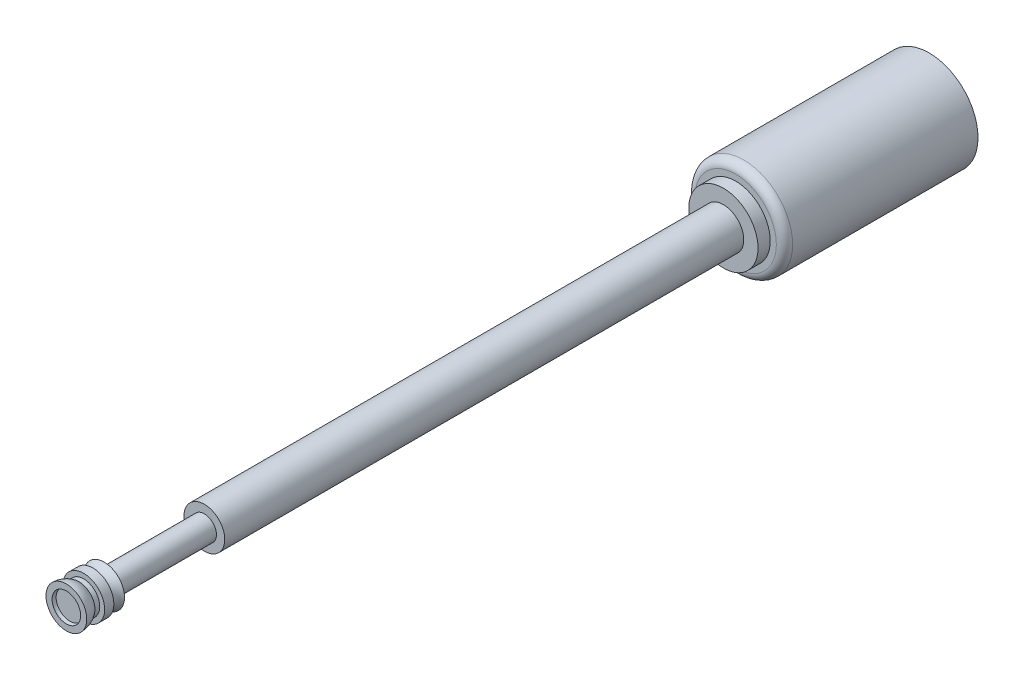
ISO-10303-21;
HEADER;
FILE_DESCRIPTION(('STEP AP214'),'2;1');
FILE_NAME('part.step','',(''),(''),'','','');
FILE_SCHEMA(('AUTOMOTIVE_DESIGN { 1 0 10303 214 1 1 1 1 }'));
ENDSEC;
DATA;
#1=APPLICATION_CONTEXT('core data for automotive mechanical design processes');
#2=APPLICATION_PROTOCOL_DEFINITION('international standard','automotive_design',2000,#1);
#3=PRODUCT_CONTEXT('',#1,'mechanical');
#4=PRODUCT('Part','Part','',(#3));
#5=PRODUCT_RELATED_PRODUCT_CATEGORY('part','',(#4));
#6=PRODUCT_DEFINITION_FORMATION('','',#4);
#7=PRODUCT_DEFINITION_CONTEXT('part definition',#1,'design');
#8=PRODUCT_DEFINITION('design','',#6,#7);
#9=PRODUCT_DEFINITION_SHAPE('','',#8);
#10=(LENGTH_UNIT() NAMED_UNIT(*) SI_UNIT(.MILLI.,.METRE.));
#11=(NAMED_UNIT(*) PLANE_ANGLE_UNIT() SI_UNIT($,.RADIAN.));
#12=(NAMED_UNIT(*) SI_UNIT($,.STERADIAN.) SOLID_ANGLE_UNIT());
#13=UNCERTAINTY_MEASURE_WITH_UNIT(LENGTH_MEASURE(1.E-05),#10,'distance_accuracy_value','');
#14=(GEOMETRIC_REPRESENTATION_CONTEXT(3) GLOBAL_UNCERTAINTY_ASSIGNED_CONTEXT((#13)) GLOBAL_UNIT_ASSIGNED_CONTEXT((#10,
#11,#12)) REPRESENTATION_CONTEXT('',''));
#15=CARTESIAN_POINT('',(0.,0.,0.));
#16=DIRECTION('',(0.,0.,1.));
#17=DIRECTION('',(1.,0.,0.));
#18=AXIS2_PLACEMENT_3D('',#15,#16,#17);
#19=CARTESIAN_POINT('',(0.,0.,15.5));
#20=DIRECTION('',(0.,0.,-1.));
#21=DIRECTION('',(-1.,0.,0.));
#22=AXIS2_PLACEMENT_3D('',#19,#20,#21);
#23=CYLINDRICAL_SURFACE('',#22,0.5);
#24=CARTESIAN_POINT('',(0.,0.,13.04));
#25=DIRECTION('',(0.,0.,-1.));
#26=DIRECTION('',(-1.,0.,0.));
#27=AXIS2_PLACEMENT_3D('',#24,#25,#26);
#28=CIRCLE('',#27,0.5);
#29=CARTESIAN_POINT('',(-0.5,0.,13.04));
#30=VERTEX_POINT('',#29);
#31=EDGE_CURVE('E60',#30,#30,#28,.T.);
#32=ORIENTED_EDGE('',*,*,#31,.T.);
#33=EDGE_LOOP('',(#32));
#34=FACE_BOUND('',#33,.T.);
#35=CARTESIAN_POINT('',(0.,0.,0.3));
#36=DIRECTION('',(0.,0.,1.));
#37=DIRECTION('',(1.,0.,0.));
#38=AXIS2_PLACEMENT_3D('',#35,#36,#37);
#39=CIRCLE('',#38,0.5);
#40=CARTESIAN_POINT('',(0.5,0.,0.3));
#41=VERTEX_POINT('',#40);
#42=EDGE_CURVE('E47',#41,#41,#39,.T.);
#43=ORIENTED_EDGE('',*,*,#42,.T.);
#44=EDGE_LOOP('',(#43));
#45=FACE_BOUND('',#44,.T.);
#46=ADVANCED_FACE('F36',(#34,#45),#23,.T.);
#47=CARTESIAN_POINT('',(0.,0.,0.3));
#48=DIRECTION('',(0.,0.,-1.));
#49=DIRECTION('',(-1.,0.,0.));
#50=AXIS2_PLACEMENT_3D('',#47,#48,#49);
#51=CYLINDRICAL_SURFACE('',#50,0.85);
#52=CARTESIAN_POINT('',(0.,0.,0.3));
#53=DIRECTION('',(0.,0.,1.));
#54=DIRECTION('',(1.,0.,0.));
#55=AXIS2_PLACEMENT_3D('',#52,#53,#54);
#56=CIRCLE('',#55,0.85);
#57=CARTESIAN_POINT('',(0.85,0.,0.3));
#58=VERTEX_POINT('',#57);
#59=EDGE_CURVE('E52',#58,#58,#56,.T.);
#60=ORIENTED_EDGE('',*,*,#59,.F.);
#61=EDGE_LOOP('',(#60));
#62=FACE_BOUND('',#61,.T.);
#63=CARTESIAN_POINT('',(0.,0.,0.));
#64=DIRECTION('',(0.,0.,1.));
#65=DIRECTION('',(1.,0.,0.));
#66=AXIS2_PLACEMENT_3D('',#63,#64,#65);
#67=CIRCLE('',#66,0.85);
#68=CARTESIAN_POINT('',(0.85,0.,0.));
#69=VERTEX_POINT('',#68);
#70=EDGE_CURVE('E106',#69,#69,#67,.T.);
#71=ORIENTED_EDGE('',*,*,#70,.T.);
#72=EDGE_LOOP('',(#71));
#73=FACE_BOUND('',#72,.T.);
#74=ADVANCED_FACE('F113',(#62,#73),#51,.T.);
#75=CARTESIAN_POINT('',(0.,0.,0.3));
#76=DIRECTION('',(0.,0.,1.));
#77=DIRECTION('',(1.,0.,0.));
#78=AXIS2_PLACEMENT_3D('',#75,#76,#77);
#79=PLANE('',#78);
#80=ORIENTED_EDGE('',*,*,#42,.F.);
#81=EDGE_LOOP('',(#80));
#82=FACE_BOUND('',#81,.T.);
#83=ORIENTED_EDGE('',*,*,#59,.T.);
#84=EDGE_LOOP('',(#83));
#85=FACE_BOUND('',#84,.T.);
#86=ADVANCED_FACE('F111',(#82,#85),#79,.T.);
#87=CARTESIAN_POINT('',(0.,0.,-4.75));
#88=DIRECTION('',(0.,0.,1.));
#89=DIRECTION('',(1.,0.,0.));
#90=AXIS2_PLACEMENT_3D('',#87,#88,#89);
#91=CYLINDRICAL_SURFACE('',#90,1.2);
#92=CARTESIAN_POINT('',(0.,0.,-0.2));
#93=DIRECTION('',(0.,0.,1.));
#94=DIRECTION('',(1.,0.,0.));
#95=AXIS2_PLACEMENT_3D('',#92,#93,#94);
#96=CIRCLE('',#95,1.2);
#97=CARTESIAN_POINT('',(1.2,0.,-0.2));
#98=VERTEX_POINT('',#97);
#99=EDGE_CURVE('E103',#98,#98,#96,.F.);
#100=ORIENTED_EDGE('',*,*,#99,.T.);
#101=EDGE_LOOP('',(#100));
#102=FACE_BOUND('',#101,.T.);
#103=CARTESIAN_POINT('',(0.,0.,-4.75));
#104=DIRECTION('',(0.,0.,1.));
#105=DIRECTION('',(1.,0.,0.));
#106=AXIS2_PLACEMENT_3D('',#103,#104,#105);
#107=CIRCLE('',#106,1.2);
#108=CARTESIAN_POINT('',(1.2,0.,-4.75));
#109=VERTEX_POINT('',#108);
#110=EDGE_CURVE('E97',#109,#109,#107,.T.);
#111=ORIENTED_EDGE('',*,*,#110,.T.);
#112=EDGE_LOOP('',(#111));
#113=FACE_BOUND('',#112,.T.);
#114=ADVANCED_FACE('F147',(#102,#113),#91,.T.);
#115=CARTESIAN_POINT('',(0.,0.,-4.75));
#116=DIRECTION('',(0.,0.,1.));
#117=DIRECTION('',(1.,0.,0.));
#118=AXIS2_PLACEMENT_3D('',#115,#116,#117);
#119=PLANE('',#118);
#120=ORIENTED_EDGE('',*,*,#110,.F.);
#121=EDGE_LOOP('',(#120));
#122=FACE_BOUND('',#121,.T.);
#123=ADVANCED_FACE('F123',(#122),#119,.F.);
#124=CARTESIAN_POINT('',(0.,0.,0.));
#125=DIRECTION('',(0.,0.,1.));
#126=DIRECTION('',(1.,0.,0.));
#127=AXIS2_PLACEMENT_3D('',#124,#125,#126);
#128=PLANE('',#127);
#129=ORIENTED_EDGE('',*,*,#70,.F.);
#130=EDGE_LOOP('',(#129));
#131=FACE_BOUND('',#130,.T.);
#132=CARTESIAN_POINT('',(0.,0.,0.));
#133=DIRECTION('',(0.,0.,1.));
#134=DIRECTION('',(1.,0.,0.));
#135=AXIS2_PLACEMENT_3D('',#132,#133,#134);
#136=CIRCLE('',#135,1.);
#137=CARTESIAN_POINT('',(1.,0.,0.));
#138=VERTEX_POINT('',#137);
#139=EDGE_CURVE('E100',#138,#138,#136,.T.);
#140=ORIENTED_EDGE('',*,*,#139,.T.);
#141=EDGE_LOOP('',(#140));
#142=FACE_BOUND('',#141,.T.);
#143=ADVANCED_FACE('F119',(#131,#142),#128,.T.);
#144=CARTESIAN_POINT('',(0.,0.,-0.2));
#145=DIRECTION('',(0.,0.,1.));
#146=DIRECTION('',(1.,0.,0.));
#147=AXIS2_PLACEMENT_3D('',#144,#145,#146);
#148=TOROIDAL_SURFACE('',#147,1.,0.2);
#149=ORIENTED_EDGE('',*,*,#99,.F.);
#150=EDGE_LOOP('',(#149));
#151=FACE_BOUND('',#150,.T.);
#152=ORIENTED_EDGE('',*,*,#139,.F.);
#153=EDGE_LOOP('',(#152));
#154=FACE_BOUND('',#153,.T.);
#155=ADVANCED_FACE('F122',(#151,#154),#148,.T.);
#156=CARTESIAN_POINT('',(-0.2962,0.,13.04));
#157=DIRECTION('',(0.,0.,-1.));
#158=DIRECTION('',(-1.,0.,0.));
#159=AXIS2_PLACEMENT_3D('',#156,#157,#158);
#160=PLANE('',#159);
#161=CARTESIAN_POINT('',(0.,0.,13.04));
#162=DIRECTION('',(0.,0.,-1.));
#163=DIRECTION('',(-1.,0.,0.));
#164=AXIS2_PLACEMENT_3D('',#161,#162,#163);
#165=CIRCLE('',#164,0.2962);
#166=CARTESIAN_POINT('',(-0.2962,0.,13.04));
#167=VERTEX_POINT('',#166);
#168=EDGE_CURVE('E68',#167,#167,#165,.T.);
#169=ORIENTED_EDGE('',*,*,#168,.T.);
#170=EDGE_LOOP('',(#169));
#171=FACE_BOUND('',#170,.T.);
#172=ORIENTED_EDGE('',*,*,#31,.F.);
#173=EDGE_LOOP('',(#172));
#174=FACE_BOUND('',#173,.T.);
#175=ADVANCED_FACE('F128',(#171,#174),#160,.F.);
#176=CARTESIAN_POINT('',(-0.2962,0.,15.5));
#177=DIRECTION('',(0.,0.,1.));
#178=DIRECTION('',(1.,0.,0.));
#179=AXIS2_PLACEMENT_3D('',#176,#177,#178);
#180=PLANE('',#179);
#181=CARTESIAN_POINT('',(0.,0.,15.5));
#182=DIRECTION('',(0.,0.,-1.));
#183=DIRECTION('',(-1.,0.,0.));
#184=AXIS2_PLACEMENT_3D('',#181,#182,#183);
#185=CIRCLE('',#184,0.2962);
#186=CARTESIAN_POINT('',(-0.2962,0.,15.5));
#187=VERTEX_POINT('',#186);
#188=EDGE_CURVE('E73',#187,#187,#185,.T.);
#189=ORIENTED_EDGE('',*,*,#188,.F.);
#190=EDGE_LOOP('',(#189));
#191=FACE_BOUND('',#190,.T.);
#192=CARTESIAN_POINT('',(0.,0.,15.5));
#193=DIRECTION('',(0.,0.,-1.));
#194=DIRECTION('',(-1.,0.,0.));
#195=AXIS2_PLACEMENT_3D('',#192,#193,#194);
#196=CIRCLE('',#195,0.5);
#197=CARTESIAN_POINT('',(-0.5,0.,15.5));
#198=VERTEX_POINT('',#197);
#199=EDGE_CURVE('E64',#198,#198,#196,.F.);
#200=ORIENTED_EDGE('',*,*,#199,.F.);
#201=EDGE_LOOP('',(#200));
#202=FACE_BOUND('',#201,.T.);
#203=ADVANCED_FACE('F134',(#191,#202),#180,.F.);
#204=CARTESIAN_POINT('',(0.,0.,15.5));
#205=DIRECTION('',(0.,0.,-1.));
#206=DIRECTION('',(-1.,0.,0.));
#207=AXIS2_PLACEMENT_3D('',#204,#205,#206);
#208=CYLINDRICAL_SURFACE('',#207,0.2962);
#209=ORIENTED_EDGE('',*,*,#168,.F.);
#210=EDGE_LOOP('',(#209));
#211=FACE_BOUND('',#210,.T.);
#212=ORIENTED_EDGE('',*,*,#188,.T.);
#213=EDGE_LOOP('',(#212));
#214=FACE_BOUND('',#213,.T.);
#215=ADVANCED_FACE('F191',(#211,#214),#208,.T.);
#216=CARTESIAN_POINT('',(0.,0.,16.34));
#217=DIRECTION('',(0.,0.,1.));
#218=DIRECTION('',(1.,0.,0.));
#219=AXIS2_PLACEMENT_3D('',#216,#217,#218);
#220=PLANE('',#219);
#221=CARTESIAN_POINT('',(0.,0.,16.34));
#222=DIRECTION('',(0.,0.,1.));
#223=DIRECTION('',(1.,0.,0.));
#224=AXIS2_PLACEMENT_3D('',#221,#222,#223);
#225=CIRCLE('',#224,0.33888604279315);
#226=CARTESIAN_POINT('',(0.338886042793151,0.,16.34));
#227=VERTEX_POINT('',#226);
#228=EDGE_CURVE('E59',#227,#227,#225,.F.);
#229=ORIENTED_EDGE('',*,*,#228,.F.);
#230=EDGE_LOOP('',(#229));
#231=FACE_BOUND('',#230,.T.);
#232=ADVANCED_FACE('F183',(#231),#220,.T.);
#233=CARTESIAN_POINT('',(0.,0.,16.4275));
#234=DIRECTION('',(0.,0.,-1.));
#235=DIRECTION('',(1.,0.,0.));
#236=AXIS2_PLACEMENT_3D('',#233,#234,#235);
#237=SPHERICAL_SURFACE('',#236,0.350000000000002);
#238=ORIENTED_EDGE('',*,*,#228,.T.);
#239=EDGE_LOOP('',(#238));
#240=FACE_BOUND('',#239,.T.);
#241=CARTESIAN_POINT('',(0.,0.,16.4275));
#242=DIRECTION('',(0.,0.,-1.));
#243=DIRECTION('',(-1.,0.,0.));
#244=AXIS2_PLACEMENT_3D('',#241,#242,#243);
#245=CIRCLE('',#244,0.350000000000002);
#246=CARTESIAN_POINT('',(-0.350000000000001,0.,16.4275));
#247=VERTEX_POINT('',#246);
#248=EDGE_CURVE('E62',#247,#247,#245,.T.);
#249=ORIENTED_EDGE('',*,*,#248,.F.);
#250=EDGE_LOOP('',(#249));
#251=FACE_BOUND('',#250,.T.);
#252=ADVANCED_FACE('F172',(#240,#251),#237,.F.);
#253=CARTESIAN_POINT('',(0.35,0.,16.4275));
#254=DIRECTION('',(0.,0.,-1.));
#255=DIRECTION('',(-1.,0.,0.));
#256=AXIS2_PLACEMENT_3D('',#253,#254,#255);
#257=PLANE('',#256);
#258=CARTESIAN_POINT('',(0.,0.,16.4275));
#259=DIRECTION('',(0.,0.,-1.));
#260=DIRECTION('',(-1.,0.,0.));
#261=AXIS2_PLACEMENT_3D('',#258,#259,#260);
#262=CIRCLE('',#261,0.5);
#263=CARTESIAN_POINT('',(-0.5,0.,16.4275));
#264=VERTEX_POINT('',#263);
#265=EDGE_CURVE('E79',#264,#264,#262,.T.);
#266=ORIENTED_EDGE('',*,*,#265,.F.);
#267=EDGE_LOOP('',(#266));
#268=FACE_BOUND('',#267,.T.);
#269=ORIENTED_EDGE('',*,*,#248,.T.);
#270=EDGE_LOOP('',(#269));
#271=FACE_BOUND('',#270,.T.);
#272=ADVANCED_FACE('F182',(#268,#271),#257,.F.);
#273=CARTESIAN_POINT('',(0.,0.,16.4275));
#274=DIRECTION('',(0.,0.,-1.));
#275=DIRECTION('',(1.,0.,0.));
#276=AXIS2_PLACEMENT_3D('',#273,#274,#275);
#277=SPHERICAL_SURFACE('',#276,0.5);
#278=CARTESIAN_POINT('',(0.,0.,16.1203770258977));
#279=DIRECTION('',(0.,0.,-1.));
#280=DIRECTION('',(-1.,0.,0.));
#281=AXIS2_PLACEMENT_3D('',#278,#279,#280);
#282=CIRCLE('',#281,0.394557320016452);
#283=CARTESIAN_POINT('',(-0.394557320016452,0.,16.1203770258977));
#284=VERTEX_POINT('',#283);
#285=EDGE_CURVE('E82',#284,#284,#282,.T.);
#286=ORIENTED_EDGE('',*,*,#285,.F.);
#287=EDGE_LOOP('',(#286));
#288=FACE_BOUND('',#287,.T.);
#289=ORIENTED_EDGE('',*,*,#265,.T.);
#290=EDGE_LOOP('',(#289));
#291=FACE_BOUND('',#290,.T.);
#292=ADVANCED_FACE('F189',(#288,#291),#277,.T.);
#293=CARTESIAN_POINT('',(0.,0.,15.5));
#294=DIRECTION('',(0.,0.,-1.));
#295=DIRECTION('',(-1.,0.,0.));
#296=AXIS2_PLACEMENT_3D('',#293,#294,#295);
#297=CYLINDRICAL_SURFACE('',#296,0.394557320016452);
#298=CARTESIAN_POINT('',(0.,0.,16.0019770416267));
#299=DIRECTION('',(0.,0.,-1.));
#300=DIRECTION('',(-1.,0.,0.));
#301=AXIS2_PLACEMENT_3D('',#298,#299,#300);
#302=CIRCLE('',#301,0.394557320016452);
#303=CARTESIAN_POINT('',(-0.394557320016452,0.,16.0019770416267));
#304=VERTEX_POINT('',#303);
#305=EDGE_CURVE('E85',#304,#304,#302,.T.);
#306=ORIENTED_EDGE('',*,*,#305,.F.);
#307=EDGE_LOOP('',(#306));
#308=FACE_BOUND('',#307,.T.);
#309=ORIENTED_EDGE('',*,*,#285,.T.);
#310=EDGE_LOOP('',(#309));
#311=FACE_BOUND('',#310,.T.);
#312=ADVANCED_FACE('F329',(#308,#311),#297,.T.);
#313=CARTESIAN_POINT('',(0.394557320016452,0.,16.0019770416267));
#314=DIRECTION('',(0.,0.,-1.));
#315=DIRECTION('',(-1.,0.,0.));
#316=AXIS2_PLACEMENT_3D('',#313,#314,#315);
#317=PLANE('',#316);
#318=CARTESIAN_POINT('',(0.,0.,16.0019770416267));
#319=DIRECTION('',(0.,0.,-1.));
#320=DIRECTION('',(-1.,0.,0.));
#321=AXIS2_PLACEMENT_3D('',#318,#319,#320);
#322=CIRCLE('',#321,0.51334471790214);
#323=CARTESIAN_POINT('',(-0.51334471790214,0.,16.0019770416267));
#324=VERTEX_POINT('',#323);
#325=EDGE_CURVE('E88',#324,#324,#322,.T.);
#326=ORIENTED_EDGE('',*,*,#325,.F.);
#327=EDGE_LOOP('',(#326));
#328=FACE_BOUND('',#327,.T.);
#329=ORIENTED_EDGE('',*,*,#305,.T.);
#330=EDGE_LOOP('',(#329));
#331=FACE_BOUND('',#330,.T.);
#332=ADVANCED_FACE('F319',(#328,#331),#317,.F.);
#333=CARTESIAN_POINT('',(0.,0.,15.5));
#334=DIRECTION('',(0.,0.,-1.));
#335=DIRECTION('',(-1.,0.,0.));
#336=AXIS2_PLACEMENT_3D('',#333,#334,#335);
#337=CYLINDRICAL_SURFACE('',#336,0.51334471790214);
#338=CARTESIAN_POINT('',(0.,0.,15.7758978004894));
#339=DIRECTION('',(0.,0.,-1.));
#340=DIRECTION('',(-1.,0.,0.));
#341=AXIS2_PLACEMENT_3D('',#338,#339,#340);
#342=CIRCLE('',#341,0.51334471790214);
#343=CARTESIAN_POINT('',(-0.51334471790214,0.,15.7758978004894));
#344=VERTEX_POINT('',#343);
#345=EDGE_CURVE('E91',#344,#344,#342,.T.);
#346=ORIENTED_EDGE('',*,*,#345,.F.);
#347=EDGE_LOOP('',(#346));
#348=FACE_BOUND('',#347,.T.);
#349=ORIENTED_EDGE('',*,*,#325,.T.);
#350=EDGE_LOOP('',(#349));
#351=FACE_BOUND('',#350,.T.);
#352=ADVANCED_FACE('F309',(#348,#351),#337,.T.);
#353=CARTESIAN_POINT('',(0.51334471790214,0.,15.7758978004894));
#354=DIRECTION('',(0.,0.,1.));
#355=DIRECTION('',(1.,0.,0.));
#356=AXIS2_PLACEMENT_3D('',#353,#354,#355);
#357=PLANE('',#356);
#358=CARTESIAN_POINT('',(0.,0.,15.7758978004894));
#359=DIRECTION('',(0.,0.,-1.));
#360=DIRECTION('',(-1.,0.,0.));
#361=AXIS2_PLACEMENT_3D('',#358,#359,#360);
#362=CIRCLE('',#361,0.386893616927053);
#363=CARTESIAN_POINT('',(-0.386893616927053,0.,15.7758978004894));
#364=VERTEX_POINT('',#363);
#365=EDGE_CURVE('E94',#364,#364,#362,.T.);
#366=ORIENTED_EDGE('',*,*,#365,.F.);
#367=EDGE_LOOP('',(#366));
#368=FACE_BOUND('',#367,.T.);
#369=ORIENTED_EDGE('',*,*,#345,.T.);
#370=EDGE_LOOP('',(#369));
#371=FACE_BOUND('',#370,.T.);
#372=ADVANCED_FACE('F300',(#368,#371),#357,.F.);
#373=CARTESIAN_POINT('',(0.,0.,15.7758978004894));
#374=DIRECTION('',(0.,0.,-1.));
#375=DIRECTION('',(-1.,0.,0.));
#376=AXIS2_PLACEMENT_3D('',#373,#374,#375);
#377=TOROIDAL_SURFACE('',#376,0.779942390086962,0.393048773159909);
#378=ORIENTED_EDGE('',*,*,#199,.T.);
#379=EDGE_LOOP('',(#378));
#380=FACE_BOUND('',#379,.T.);
#381=ORIENTED_EDGE('',*,*,#365,.T.);
#382=EDGE_LOOP('',(#381));
#383=FACE_BOUND('',#382,.T.);
#384=ADVANCED_FACE('F297',(#380,#383),#377,.F.);
#385=CLOSED_SHELL('',(#46,#74,#86,#114,#123,#143,#155,#175,#203,#215,#232,#252,#272,#292,#312,
#332,#352,#372,#384));
#386=CARTESIAN_POINT('',(0.,0.,16.3055225127507));
#387=DIRECTION('',(0.,0.,-1.));
#388=DIRECTION('',(-1.,0.,0.));
#389=AXIS2_PLACEMENT_3D('',#386,#387,#388);
#390=CIRCLE('',#389,0.328057148381722);
#391=CARTESIAN_POINT('',(-0.328057148381722,0.,16.3055225127507));
#392=VERTEX_POINT('',#391);
#393=EDGE_CURVE('E56',#392,#392,#390,.F.);
#394=ORIENTED_EDGE('',*,*,#393,.T.);
#395=EDGE_LOOP('',(#394));
#396=FACE_BOUND('',#395,.T.);
#397=ADVANCED_FACE('F167',(#396),#237,.F.);
#398=CARTESIAN_POINT('',(0.,0.,16.3055225127507));
#399=DIRECTION('',(0.,0.,-1.));
#400=DIRECTION('',(-1.,0.,0.));
#401=AXIS2_PLACEMENT_3D('',#398,#399,#400);
#402=PLANE('',#401);
#403=ORIENTED_EDGE('',*,*,#393,.F.);
#404=EDGE_LOOP('',(#403));
#405=FACE_BOUND('',#404,.T.);
#406=ADVANCED_FACE('F169',(#405),#402,.T.);
#407=CLOSED_SHELL('',(#397,#406));
#408=CARTESIAN_POINT('',(0.,0.,-1.91));
#409=DIRECTION('',(0.,0.,-1.));
#410=DIRECTION('',(-1.,0.,0.));
#411=AXIS2_PLACEMENT_3D('',#408,#409,#410);
#412=PLANE('',#411);
#413=CARTESIAN_POINT('',(0.,0.,-1.91));
#414=DIRECTION('',(0.,0.,-1.));
#415=DIRECTION('',(-1.,0.,0.));
#416=AXIS2_PLACEMENT_3D('',#413,#414,#415);
#417=CIRCLE('',#416,0.5);
#418=CARTESIAN_POINT('',(-0.5,0.,-1.91));
#419=VERTEX_POINT('',#418);
#420=EDGE_CURVE('E10',#419,#419,#417,.F.);
#421=ORIENTED_EDGE('',*,*,#420,.T.);
#422=EDGE_LOOP('',(#421));
#423=FACE_BOUND('',#422,.T.);
#424=ADVANCED_FACE('F156',(#423),#412,.F.);
#425=CARTESIAN_POINT('',(0.,0.,0.));
#426=DIRECTION('',(0.,0.,1.));
#427=DIRECTION('',(1.,0.,0.));
#428=AXIS2_PLACEMENT_3D('',#425,#426,#427);
#429=PLANE('',#428);
#430=CARTESIAN_POINT('',(0.,0.,0.));
#431=DIRECTION('',(0.,0.,1.));
#432=DIRECTION('',(1.,0.,0.));
#433=AXIS2_PLACEMENT_3D('',#430,#431,#432);
#434=CIRCLE('',#433,0.5);
#435=CARTESIAN_POINT('',(0.5,0.,0.));
#436=VERTEX_POINT('',#435);
#437=EDGE_CURVE('E43',#436,#436,#434,.T.);
#438=ORIENTED_EDGE('',*,*,#437,.F.);
#439=EDGE_LOOP('',(#438));
#440=FACE_BOUND('',#439,.T.);
#441=ADVANCED_FACE('F153',(#440),#429,.F.);
#442=CARTESIAN_POINT('',(0.,0.,-4.75));
#443=DIRECTION('',(0.,0.,1.));
#444=DIRECTION('',(1.,0.,0.));
#445=AXIS2_PLACEMENT_3D('',#442,#443,#444);
#446=CYLINDRICAL_SURFACE('',#445,0.5);
#447=ORIENTED_EDGE('',*,*,#437,.T.);
#448=EDGE_LOOP('',(#447));
#449=FACE_BOUND('',#448,.T.);
#450=ORIENTED_EDGE('',*,*,#420,.F.);
#451=EDGE_LOOP('',(#450));
#452=FACE_BOUND('',#451,.T.);
#453=ADVANCED_FACE('F155',(#449,#452),#446,.F.);
#454=CLOSED_SHELL('',(#424,#441,#453));
#455=ORIENTED_CLOSED_SHELL('',*,#407,.T.);
#456=ORIENTED_CLOSED_SHELL('',*,#454,.T.);
#457=BREP_WITH_VOIDS('B2',#385,(#455,#456));
#458=ADVANCED_BREP_SHAPE_REPRESENTATION('',(#18,#457),#14);
#459=SHAPE_DEFINITION_REPRESENTATION(#9,#458);
ENDSEC;
END-ISO-10303-21;
